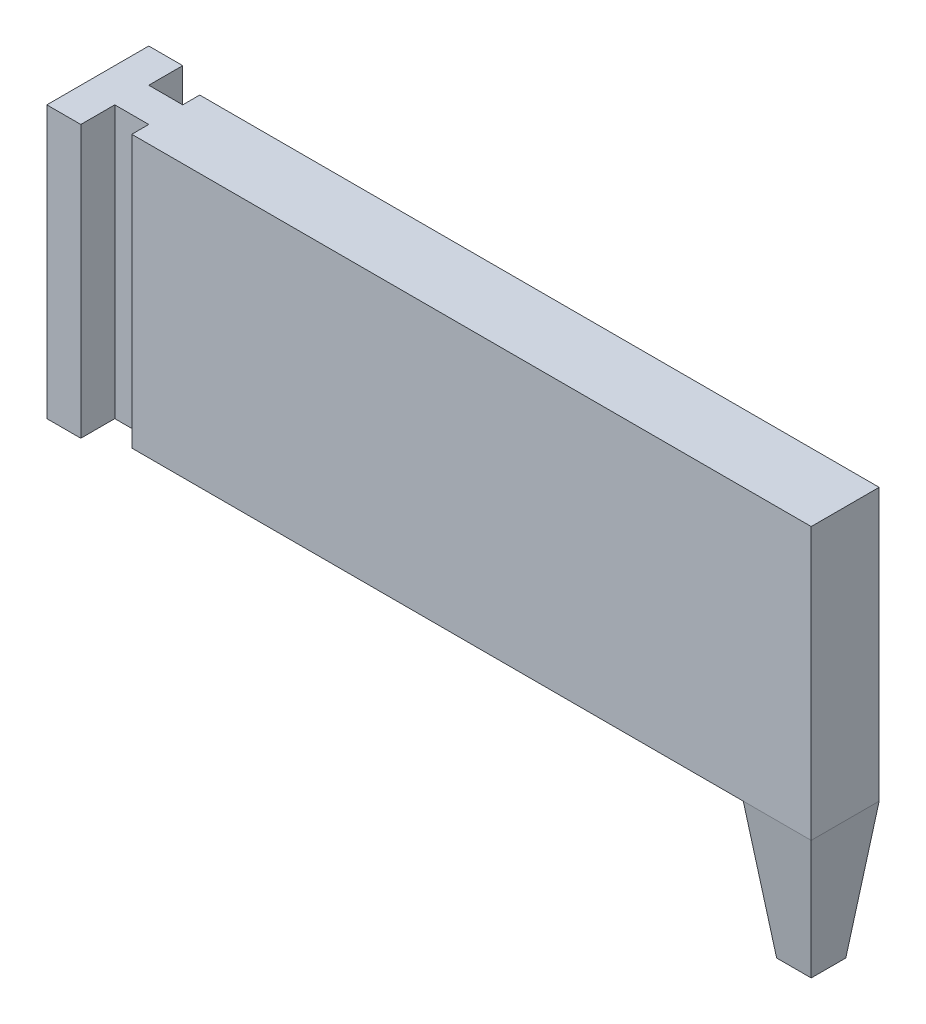
ISO-10303-21;
HEADER;
FILE_DESCRIPTION(('STEP AP214'),'2;1');
FILE_NAME('part.step','',(''),(''),'','','');
FILE_SCHEMA(('AUTOMOTIVE_DESIGN { 1 0 10303 214 1 1 1 1 }'));
ENDSEC;
DATA;
#1=APPLICATION_CONTEXT('core data for automotive mechanical design processes');
#2=APPLICATION_PROTOCOL_DEFINITION('international standard','automotive_design',2000,#1);
#3=PRODUCT_CONTEXT('',#1,'mechanical');
#4=PRODUCT('Part','Part','',(#3));
#5=PRODUCT_RELATED_PRODUCT_CATEGORY('part','',(#4));
#6=PRODUCT_DEFINITION_FORMATION('','',#4);
#7=PRODUCT_DEFINITION_CONTEXT('part definition',#1,'design');
#8=PRODUCT_DEFINITION('design','',#6,#7);
#9=PRODUCT_DEFINITION_SHAPE('','',#8);
#10=(LENGTH_UNIT() NAMED_UNIT(*) SI_UNIT(.MILLI.,.METRE.));
#11=(NAMED_UNIT(*) PLANE_ANGLE_UNIT() SI_UNIT($,.RADIAN.));
#12=(NAMED_UNIT(*) SI_UNIT($,.STERADIAN.) SOLID_ANGLE_UNIT());
#13=UNCERTAINTY_MEASURE_WITH_UNIT(LENGTH_MEASURE(1.E-05),#10,'distance_accuracy_value','');
#14=(GEOMETRIC_REPRESENTATION_CONTEXT(3) GLOBAL_UNCERTAINTY_ASSIGNED_CONTEXT((#13)) GLOBAL_UNIT_ASSIGNED_CONTEXT((#10,
#11,#12)) REPRESENTATION_CONTEXT('',''));
#15=CARTESIAN_POINT('',(0.,0.,0.));
#16=DIRECTION('',(0.,0.,1.));
#17=DIRECTION('',(1.,0.,0.));
#18=AXIS2_PLACEMENT_3D('',#15,#16,#17);
#19=CARTESIAN_POINT('',(0.,0.,0.));
#20=DIRECTION('',(0.,1.,0.));
#21=DIRECTION('',(0.,0.,1.));
#22=AXIS2_PLACEMENT_3D('',#19,#20,#21);
#23=PLANE('',#22);
#24=DIRECTION('',(0.,0.,-1.));
#25=VECTOR('',#24,1.);
#26=CARTESIAN_POINT('',(90.,0.,-5.));
#27=LINE('',#26,#25);
#28=CARTESIAN_POINT('',(90.,0.,5.));
#29=VERTEX_POINT('',#28);
#30=CARTESIAN_POINT('',(90.,0.,-5.));
#31=VERTEX_POINT('',#30);
#32=EDGE_CURVE('E61',#29,#31,#27,.T.);
#33=ORIENTED_EDGE('',*,*,#32,.F.);
#34=DIRECTION('',(1.,0.,0.));
#35=VECTOR('',#34,1.);
#36=CARTESIAN_POINT('',(0.,0.,5.));
#37=LINE('',#36,#35);
#38=CARTESIAN_POINT('',(0.,0.,5.));
#39=VERTEX_POINT('',#38);
#40=EDGE_CURVE('E435',#39,#29,#37,.T.);
#41=ORIENTED_EDGE('',*,*,#40,.F.);
#42=DIRECTION('',(0.,0.,1.));
#43=VECTOR('',#42,1.);
#44=CARTESIAN_POINT('',(0.,0.,-5.));
#45=LINE('',#44,#43);
#46=CARTESIAN_POINT('',(0.,0.,2.5));
#47=VERTEX_POINT('',#46);
#48=EDGE_CURVE('E175',#47,#39,#45,.T.);
#49=ORIENTED_EDGE('',*,*,#48,.F.);
#50=DIRECTION('',(1.,0.,0.));
#51=VECTOR('',#50,1.);
#52=CARTESIAN_POINT('',(-5.,0.,2.5));
#53=LINE('',#52,#51);
#54=CARTESIAN_POINT('',(-5.,0.,2.5));
#55=VERTEX_POINT('',#54);
#56=EDGE_CURVE('E200',#55,#47,#53,.T.);
#57=ORIENTED_EDGE('',*,*,#56,.F.);
#58=DIRECTION('',(0.,0.,-1.));
#59=VECTOR('',#58,1.);
#60=CARTESIAN_POINT('',(-5.00000000000001,0.,7.5));
#61=LINE('',#60,#59);
#62=CARTESIAN_POINT('',(-5.00000000000001,0.,7.5));
#63=VERTEX_POINT('',#62);
#64=EDGE_CURVE('E197',#63,#55,#61,.T.);
#65=ORIENTED_EDGE('',*,*,#64,.F.);
#66=DIRECTION('',(1.,0.,0.));
#67=VECTOR('',#66,1.);
#68=CARTESIAN_POINT('',(-10.,0.,7.5));
#69=LINE('',#68,#67);
#70=CARTESIAN_POINT('',(-10.,0.,7.5));
#71=VERTEX_POINT('',#70);
#72=EDGE_CURVE('E194',#71,#63,#69,.T.);
#73=ORIENTED_EDGE('',*,*,#72,.F.);
#74=DIRECTION('',(0.,0.,1.));
#75=VECTOR('',#74,1.);
#76=CARTESIAN_POINT('',(-10.,0.,-7.5));
#77=LINE('',#76,#75);
#78=CARTESIAN_POINT('',(-10.,0.,-7.5));
#79=VERTEX_POINT('',#78);
#80=EDGE_CURVE('E159',#79,#71,#77,.T.);
#81=ORIENTED_EDGE('',*,*,#80,.F.);
#82=DIRECTION('',(-1.,0.,0.));
#83=VECTOR('',#82,1.);
#84=CARTESIAN_POINT('',(-5.00000000000001,0.,-7.5));
#85=LINE('',#84,#83);
#86=CARTESIAN_POINT('',(-5.00000000000001,0.,-7.5));
#87=VERTEX_POINT('',#86);
#88=EDGE_CURVE('E153',#87,#79,#85,.T.);
#89=ORIENTED_EDGE('',*,*,#88,.F.);
#90=DIRECTION('',(0.,0.,-1.));
#91=VECTOR('',#90,1.);
#92=CARTESIAN_POINT('',(-5.,0.,-2.5));
#93=LINE('',#92,#91);
#94=CARTESIAN_POINT('',(-5.,0.,-2.5));
#95=VERTEX_POINT('',#94);
#96=EDGE_CURVE('E100',#95,#87,#93,.T.);
#97=ORIENTED_EDGE('',*,*,#96,.F.);
#98=DIRECTION('',(-1.,0.,0.));
#99=VECTOR('',#98,1.);
#100=CARTESIAN_POINT('',(0.,0.,-2.5));
#101=LINE('',#100,#99);
#102=CARTESIAN_POINT('',(0.,0.,-2.5));
#103=VERTEX_POINT('',#102);
#104=EDGE_CURVE('E204',#103,#95,#101,.T.);
#105=ORIENTED_EDGE('',*,*,#104,.F.);
#106=CARTESIAN_POINT('',(0.,0.,-5.));
#107=VERTEX_POINT('',#106);
#108=EDGE_CURVE('E143',#107,#103,#45,.T.);
#109=ORIENTED_EDGE('',*,*,#108,.F.);
#110=DIRECTION('',(1.,0.,0.));
#111=VECTOR('',#110,1.);
#112=CARTESIAN_POINT('',(0.,0.,-5.));
#113=LINE('',#112,#111);
#114=EDGE_CURVE('E468',#107,#31,#113,.T.);
#115=ORIENTED_EDGE('',*,*,#114,.T.);
#116=EDGE_LOOP('',(#33,#41,#49,#57,#65,#73,#81,#89,#97,#105,#109,#115));
#117=FACE_BOUND('',#116,.T.);
#118=ADVANCED_FACE('F45',(#117),#23,.F.);
#119=CARTESIAN_POINT('',(-5.00000000000001,40.,-7.5));
#120=DIRECTION('',(0.,0.,1.));
#121=DIRECTION('',(1.,0.,0.));
#122=AXIS2_PLACEMENT_3D('',#119,#120,#121);
#123=PLANE('',#122);
#124=ORIENTED_EDGE('',*,*,#88,.T.);
#125=DIRECTION('',(0.,-1.,0.));
#126=VECTOR('',#125,1.);
#127=CARTESIAN_POINT('',(-10.,40.,-7.5));
#128=LINE('',#127,#126);
#129=CARTESIAN_POINT('',(-10.,40.,-7.5));
#130=VERTEX_POINT('',#129);
#131=EDGE_CURVE('E11',#130,#79,#128,.T.);
#132=ORIENTED_EDGE('',*,*,#131,.F.);
#133=DIRECTION('',(-1.,0.,0.));
#134=VECTOR('',#133,1.);
#135=CARTESIAN_POINT('',(-5.00000000000001,40.,-7.5));
#136=LINE('',#135,#134);
#137=CARTESIAN_POINT('',(-5.00000000000001,40.,-7.5));
#138=VERTEX_POINT('',#137);
#139=EDGE_CURVE('E176',#138,#130,#136,.T.);
#140=ORIENTED_EDGE('',*,*,#139,.F.);
#141=DIRECTION('',(0.,-1.,0.));
#142=VECTOR('',#141,1.);
#143=CARTESIAN_POINT('',(-5.00000000000001,40.,-7.5));
#144=LINE('',#143,#142);
#145=EDGE_CURVE('E190',#138,#87,#144,.T.);
#146=ORIENTED_EDGE('',*,*,#145,.T.);
#147=EDGE_LOOP('',(#124,#132,#140,#146));
#148=FACE_BOUND('',#147,.T.);
#149=ADVANCED_FACE('F47',(#148),#123,.F.);
#150=CARTESIAN_POINT('',(-10.,40.,-7.5));
#151=DIRECTION('',(1.,0.,0.));
#152=DIRECTION('',(0.,0.,-1.));
#153=AXIS2_PLACEMENT_3D('',#150,#151,#152);
#154=PLANE('',#153);
#155=ORIENTED_EDGE('',*,*,#80,.T.);
#156=DIRECTION('',(0.,-1.,0.));
#157=VECTOR('',#156,1.);
#158=CARTESIAN_POINT('',(-10.,40.,7.5));
#159=LINE('',#158,#157);
#160=CARTESIAN_POINT('',(-10.,40.,7.5));
#161=VERTEX_POINT('',#160);
#162=EDGE_CURVE('E54',#161,#71,#159,.T.);
#163=ORIENTED_EDGE('',*,*,#162,.F.);
#164=DIRECTION('',(0.,0.,1.));
#165=VECTOR('',#164,1.);
#166=CARTESIAN_POINT('',(-10.,40.,-7.5));
#167=LINE('',#166,#165);
#168=EDGE_CURVE('E108',#130,#161,#167,.T.);
#169=ORIENTED_EDGE('',*,*,#168,.F.);
#170=ORIENTED_EDGE('',*,*,#131,.T.);
#171=EDGE_LOOP('',(#155,#163,#169,#170));
#172=FACE_BOUND('',#171,.T.);
#173=ADVANCED_FACE('F249',(#172),#154,.F.);
#174=CARTESIAN_POINT('',(-10.,40.,7.5));
#175=DIRECTION('',(0.,0.,-1.));
#176=DIRECTION('',(-1.,0.,0.));
#177=AXIS2_PLACEMENT_3D('',#174,#175,#176);
#178=PLANE('',#177);
#179=ORIENTED_EDGE('',*,*,#72,.T.);
#180=DIRECTION('',(0.,-1.,0.));
#181=VECTOR('',#180,1.);
#182=CARTESIAN_POINT('',(-5.00000000000001,40.,7.5));
#183=LINE('',#182,#181);
#184=CARTESIAN_POINT('',(-5.00000000000001,40.,7.5));
#185=VERTEX_POINT('',#184);
#186=EDGE_CURVE('E220',#185,#63,#183,.T.);
#187=ORIENTED_EDGE('',*,*,#186,.F.);
#188=DIRECTION('',(1.,0.,0.));
#189=VECTOR('',#188,1.);
#190=CARTESIAN_POINT('',(-10.,40.,7.5));
#191=LINE('',#190,#189);
#192=EDGE_CURVE('E181',#161,#185,#191,.T.);
#193=ORIENTED_EDGE('',*,*,#192,.F.);
#194=ORIENTED_EDGE('',*,*,#162,.T.);
#195=EDGE_LOOP('',(#179,#187,#193,#194));
#196=FACE_BOUND('',#195,.T.);
#197=ADVANCED_FACE('F228',(#196),#178,.F.);
#198=CARTESIAN_POINT('',(-5.00000000000001,40.,7.5));
#199=DIRECTION('',(-1.,0.,0.));
#200=DIRECTION('',(0.,0.,1.));
#201=AXIS2_PLACEMENT_3D('',#198,#199,#200);
#202=PLANE('',#201);
#203=ORIENTED_EDGE('',*,*,#64,.T.);
#204=DIRECTION('',(0.,-1.,0.));
#205=VECTOR('',#204,1.);
#206=CARTESIAN_POINT('',(-5.,40.,2.5));
#207=LINE('',#206,#205);
#208=CARTESIAN_POINT('',(-5.,40.,2.5));
#209=VERTEX_POINT('',#208);
#210=EDGE_CURVE('E216',#209,#55,#207,.T.);
#211=ORIENTED_EDGE('',*,*,#210,.F.);
#212=DIRECTION('',(0.,0.,-1.));
#213=VECTOR('',#212,1.);
#214=CARTESIAN_POINT('',(-5.00000000000001,40.,7.5));
#215=LINE('',#214,#213);
#216=EDGE_CURVE('E184',#185,#209,#215,.T.);
#217=ORIENTED_EDGE('',*,*,#216,.F.);
#218=ORIENTED_EDGE('',*,*,#186,.T.);
#219=EDGE_LOOP('',(#203,#211,#217,#218));
#220=FACE_BOUND('',#219,.T.);
#221=ADVANCED_FACE('F236',(#220),#202,.F.);
#222=CARTESIAN_POINT('',(-5.,40.,2.5));
#223=DIRECTION('',(0.,0.,-1.));
#224=DIRECTION('',(-1.,0.,0.));
#225=AXIS2_PLACEMENT_3D('',#222,#223,#224);
#226=PLANE('',#225);
#227=ORIENTED_EDGE('',*,*,#56,.T.);
#228=DIRECTION('',(0.,-1.,0.));
#229=VECTOR('',#228,1.);
#230=CARTESIAN_POINT('',(0.,40.,2.5));
#231=LINE('',#230,#229);
#232=CARTESIAN_POINT('',(0.,40.,2.5));
#233=VERTEX_POINT('',#232);
#234=EDGE_CURVE('E145',#233,#47,#231,.T.);
#235=ORIENTED_EDGE('',*,*,#234,.F.);
#236=DIRECTION('',(1.,0.,0.));
#237=VECTOR('',#236,1.);
#238=CARTESIAN_POINT('',(-5.,40.,2.5));
#239=LINE('',#238,#237);
#240=EDGE_CURVE('E132',#209,#233,#239,.T.);
#241=ORIENTED_EDGE('',*,*,#240,.F.);
#242=ORIENTED_EDGE('',*,*,#210,.T.);
#243=EDGE_LOOP('',(#227,#235,#241,#242));
#244=FACE_BOUND('',#243,.T.);
#245=ADVANCED_FACE('F240',(#244),#226,.F.);
#246=CARTESIAN_POINT('',(0.,40.,-2.5));
#247=DIRECTION('',(0.,0.,1.));
#248=DIRECTION('',(1.,0.,0.));
#249=AXIS2_PLACEMENT_3D('',#246,#247,#248);
#250=PLANE('',#249);
#251=ORIENTED_EDGE('',*,*,#104,.T.);
#252=DIRECTION('',(0.,-1.,0.));
#253=VECTOR('',#252,1.);
#254=CARTESIAN_POINT('',(-5.,40.,-2.5));
#255=LINE('',#254,#253);
#256=CARTESIAN_POINT('',(-5.,40.,-2.5));
#257=VERTEX_POINT('',#256);
#258=EDGE_CURVE('E129',#257,#95,#255,.T.);
#259=ORIENTED_EDGE('',*,*,#258,.F.);
#260=DIRECTION('',(-1.,0.,0.));
#261=VECTOR('',#260,1.);
#262=CARTESIAN_POINT('',(0.,40.,-2.5));
#263=LINE('',#262,#261);
#264=CARTESIAN_POINT('',(0.,40.,-2.5));
#265=VERTEX_POINT('',#264);
#266=EDGE_CURVE('E124',#265,#257,#263,.T.);
#267=ORIENTED_EDGE('',*,*,#266,.F.);
#268=DIRECTION('',(0.,-1.,0.));
#269=VECTOR('',#268,1.);
#270=CARTESIAN_POINT('',(0.,40.,-2.5));
#271=LINE('',#270,#269);
#272=EDGE_CURVE('E127',#265,#103,#271,.T.);
#273=ORIENTED_EDGE('',*,*,#272,.T.);
#274=EDGE_LOOP('',(#251,#259,#267,#273));
#275=FACE_BOUND('',#274,.T.);
#276=ADVANCED_FACE('F126',(#275),#250,.F.);
#277=CARTESIAN_POINT('',(-5.,40.,-2.5));
#278=DIRECTION('',(-1.,0.,0.));
#279=DIRECTION('',(0.,0.,1.));
#280=AXIS2_PLACEMENT_3D('',#277,#278,#279);
#281=PLANE('',#280);
#282=ORIENTED_EDGE('',*,*,#96,.T.);
#283=ORIENTED_EDGE('',*,*,#145,.F.);
#284=DIRECTION('',(0.,0.,-1.));
#285=VECTOR('',#284,1.);
#286=CARTESIAN_POINT('',(-5.,40.,-2.5));
#287=LINE('',#286,#285);
#288=EDGE_CURVE('E70',#257,#138,#287,.T.);
#289=ORIENTED_EDGE('',*,*,#288,.F.);
#290=ORIENTED_EDGE('',*,*,#258,.T.);
#291=EDGE_LOOP('',(#282,#283,#289,#290));
#292=FACE_BOUND('',#291,.T.);
#293=ADVANCED_FACE('F265',(#292),#281,.F.);
#294=CARTESIAN_POINT('',(0.,40.,0.));
#295=DIRECTION('',(0.,1.,0.));
#296=DIRECTION('',(0.,0.,1.));
#297=AXIS2_PLACEMENT_3D('',#294,#295,#296);
#298=PLANE('',#297);
#299=ORIENTED_EDGE('',*,*,#139,.T.);
#300=ORIENTED_EDGE('',*,*,#168,.T.);
#301=ORIENTED_EDGE('',*,*,#192,.T.);
#302=ORIENTED_EDGE('',*,*,#216,.T.);
#303=ORIENTED_EDGE('',*,*,#240,.T.);
#304=DIRECTION('',(0.,0.,1.));
#305=VECTOR('',#304,1.);
#306=CARTESIAN_POINT('',(0.,40.,-5.));
#307=LINE('',#306,#305);
#308=CARTESIAN_POINT('',(0.,40.,5.));
#309=VERTEX_POINT('',#308);
#310=EDGE_CURVE('E154',#233,#309,#307,.T.);
#311=ORIENTED_EDGE('',*,*,#310,.T.);
#312=DIRECTION('',(-1.,0.,0.));
#313=VECTOR('',#312,1.);
#314=CARTESIAN_POINT('',(100.,40.0000000000007,5.));
#315=LINE('',#314,#313);
#316=CARTESIAN_POINT('',(100.,40.0000000000007,5.));
#317=VERTEX_POINT('',#316);
#318=EDGE_CURVE('E462',#317,#309,#315,.T.);
#319=ORIENTED_EDGE('',*,*,#318,.F.);
#320=DIRECTION('',(0.,0.,1.));
#321=VECTOR('',#320,1.);
#322=CARTESIAN_POINT('',(100.,40.0000000000007,-5.));
#323=LINE('',#322,#321);
#324=CARTESIAN_POINT('',(100.,40.0000000000007,-5.));
#325=VERTEX_POINT('',#324);
#326=EDGE_CURVE('E162',#325,#317,#323,.T.);
#327=ORIENTED_EDGE('',*,*,#326,.F.);
#328=DIRECTION('',(-1.,0.,0.));
#329=VECTOR('',#328,1.);
#330=CARTESIAN_POINT('',(100.,40.0000000000007,-5.));
#331=LINE('',#330,#329);
#332=CARTESIAN_POINT('',(0.,40.,-5.));
#333=VERTEX_POINT('',#332);
#334=EDGE_CURVE('E151',#325,#333,#331,.T.);
#335=ORIENTED_EDGE('',*,*,#334,.T.);
#336=EDGE_CURVE('E140',#333,#265,#307,.T.);
#337=ORIENTED_EDGE('',*,*,#336,.T.);
#338=ORIENTED_EDGE('',*,*,#266,.T.);
#339=ORIENTED_EDGE('',*,*,#288,.T.);
#340=EDGE_LOOP('',(#299,#300,#301,#302,#303,#311,#319,#327,#335,#337,#338,#339));
#341=FACE_BOUND('',#340,.T.);
#342=ADVANCED_FACE('F148',(#341),#298,.T.);
#343=CARTESIAN_POINT('',(0.,40.,-5.));
#344=DIRECTION('',(-1.,0.,0.));
#345=DIRECTION('',(0.,0.,1.));
#346=AXIS2_PLACEMENT_3D('',#343,#344,#345);
#347=PLANE('',#346);
#348=ORIENTED_EDGE('',*,*,#272,.F.);
#349=ORIENTED_EDGE('',*,*,#336,.F.);
#350=DIRECTION('',(0.,-1.,0.));
#351=VECTOR('',#350,1.);
#352=CARTESIAN_POINT('',(0.,40.,-5.));
#353=LINE('',#352,#351);
#354=EDGE_CURVE('E465',#333,#107,#353,.T.);
#355=ORIENTED_EDGE('',*,*,#354,.T.);
#356=ORIENTED_EDGE('',*,*,#108,.T.);
#357=EDGE_LOOP('',(#348,#349,#355,#356));
#358=FACE_BOUND('',#357,.T.);
#359=ADVANCED_FACE('F137',(#358),#347,.T.);
#360=ORIENTED_EDGE('',*,*,#310,.F.);
#361=ORIENTED_EDGE('',*,*,#234,.T.);
#362=ORIENTED_EDGE('',*,*,#48,.T.);
#363=DIRECTION('',(0.,-1.,0.));
#364=VECTOR('',#363,1.);
#365=CARTESIAN_POINT('',(0.,40.,5.));
#366=LINE('',#365,#364);
#367=EDGE_CURVE('E429',#309,#39,#366,.T.);
#368=ORIENTED_EDGE('',*,*,#367,.F.);
#369=EDGE_LOOP('',(#360,#361,#362,#368));
#370=FACE_BOUND('',#369,.T.);
#371=ADVANCED_FACE('F304',(#370),#347,.T.);
#372=CARTESIAN_POINT('',(100.,0.,-5.));
#373=DIRECTION('',(1.,0.,0.));
#374=DIRECTION('',(0.,1.,0.));
#375=AXIS2_PLACEMENT_3D('',#372,#373,#374);
#376=PLANE('',#375);
#377=ORIENTED_EDGE('',*,*,#326,.T.);
#378=DIRECTION('',(0.,1.,0.));
#379=VECTOR('',#378,1.);
#380=CARTESIAN_POINT('',(100.,0.,5.));
#381=LINE('',#380,#379);
#382=CARTESIAN_POINT('',(100.,0.,5.));
#383=VERTEX_POINT('',#382);
#384=EDGE_CURVE('E458',#383,#317,#381,.T.);
#385=ORIENTED_EDGE('',*,*,#384,.F.);
#386=DIRECTION('',(0.,0.,1.));
#387=VECTOR('',#386,1.);
#388=CARTESIAN_POINT('',(100.,0.,-5.));
#389=LINE('',#388,#387);
#390=CARTESIAN_POINT('',(100.,0.,-5.));
#391=VERTEX_POINT('',#390);
#392=EDGE_CURVE('E169',#391,#383,#389,.T.);
#393=ORIENTED_EDGE('',*,*,#392,.F.);
#394=DIRECTION('',(0.,1.,0.));
#395=VECTOR('',#394,1.);
#396=CARTESIAN_POINT('',(100.,0.,-5.));
#397=LINE('',#396,#395);
#398=EDGE_CURVE('E470',#391,#325,#397,.T.);
#399=ORIENTED_EDGE('',*,*,#398,.T.);
#400=EDGE_LOOP('',(#377,#385,#393,#399));
#401=FACE_BOUND('',#400,.T.);
#402=ADVANCED_FACE('F310',(#401),#376,.T.);
#403=CARTESIAN_POINT('',(0.,0.,-5.));
#404=DIRECTION('',(0.,0.,1.));
#405=DIRECTION('',(1.,0.,0.));
#406=AXIS2_PLACEMENT_3D('',#403,#404,#405);
#407=PLANE('',#406);
#408=ORIENTED_EDGE('',*,*,#354,.F.);
#409=ORIENTED_EDGE('',*,*,#334,.F.);
#410=ORIENTED_EDGE('',*,*,#398,.F.);
#411=DIRECTION('',(1.,0.,0.));
#412=VECTOR('',#411,1.);
#413=CARTESIAN_POINT('',(100.,0.,-5.));
#414=LINE('',#413,#412);
#415=EDGE_CURVE('E421',#31,#391,#414,.T.);
#416=ORIENTED_EDGE('',*,*,#415,.F.);
#417=ORIENTED_EDGE('',*,*,#114,.F.);
#418=EDGE_LOOP('',(#408,#409,#410,#416,#417));
#419=FACE_BOUND('',#418,.T.);
#420=ADVANCED_FACE('F321',(#419),#407,.F.);
#421=CARTESIAN_POINT('',(0.,0.,5.));
#422=DIRECTION('',(0.,0.,1.));
#423=DIRECTION('',(1.,0.,0.));
#424=AXIS2_PLACEMENT_3D('',#421,#422,#423);
#425=PLANE('',#424);
#426=ORIENTED_EDGE('',*,*,#367,.T.);
#427=ORIENTED_EDGE('',*,*,#40,.T.);
#428=DIRECTION('',(-1.,0.,0.));
#429=VECTOR('',#428,1.);
#430=CARTESIAN_POINT('',(100.,0.,5.));
#431=LINE('',#430,#429);
#432=EDGE_CURVE('E498',#383,#29,#431,.T.);
#433=ORIENTED_EDGE('',*,*,#432,.F.);
#434=ORIENTED_EDGE('',*,*,#384,.T.);
#435=ORIENTED_EDGE('',*,*,#318,.T.);
#436=EDGE_LOOP('',(#426,#427,#433,#434,#435));
#437=FACE_BOUND('',#436,.T.);
#438=ADVANCED_FACE('F331',(#437),#425,.T.);
#439=CARTESIAN_POINT('',(100.,0.,-5.));
#440=DIRECTION('',(0.992546151641322,-0.121869343405148,0.));
#441=DIRECTION('',(0.121869343405148,0.992546151641322,0.));
#442=AXIS2_PLACEMENT_3D('',#439,#440,#441);
#443=PLANE('',#442);
#444=ORIENTED_EDGE('',*,*,#392,.T.);
#445=DIRECTION('',(0.120974291151355,0.985256536015293,0.120974291151355));
#446=VECTOR('',#445,1.);
#447=CARTESIAN_POINT('',(100.,0.,5.));
#448=LINE('',#447,#446);
#449=CARTESIAN_POINT('',(97.5443087819419,-20.,2.54430878194191));
#450=VERTEX_POINT('',#449);
#451=EDGE_CURVE('E424',#450,#383,#448,.T.);
#452=ORIENTED_EDGE('',*,*,#451,.F.);
#453=DIRECTION('',(0.,0.,-1.));
#454=VECTOR('',#453,1.);
#455=CARTESIAN_POINT('',(97.5443087819419,-20.,-5.));
#456=LINE('',#455,#454);
#457=CARTESIAN_POINT('',(97.5443087819419,-20.,-2.54430878194191));
#458=VERTEX_POINT('',#457);
#459=EDGE_CURVE('E406',#458,#450,#456,.F.);
#460=ORIENTED_EDGE('',*,*,#459,.F.);
#461=DIRECTION('',(0.120974291151355,0.985256536015293,-0.120974291151355));
#462=VECTOR('',#461,1.);
#463=CARTESIAN_POINT('',(100.,0.,-5.));
#464=LINE('',#463,#462);
#465=EDGE_CURVE('E443',#458,#391,#464,.T.);
#466=ORIENTED_EDGE('',*,*,#465,.T.);
#467=EDGE_LOOP('',(#444,#452,#460,#466));
#468=FACE_BOUND('',#467,.T.);
#469=ADVANCED_FACE('F341',(#468),#443,.T.);
#470=CARTESIAN_POINT('',(100.,0.,5.));
#471=DIRECTION('',(0.,-0.121869343405148,0.992546151641322));
#472=DIRECTION('',(0.,-0.992546151641322,-0.121869343405148));
#473=AXIS2_PLACEMENT_3D('',#470,#471,#472);
#474=PLANE('',#473);
#475=ORIENTED_EDGE('',*,*,#432,.T.);
#476=DIRECTION('',(-0.120974291151355,0.985256536015293,0.120974291151355));
#477=VECTOR('',#476,1.);
#478=CARTESIAN_POINT('',(90.1463477911958,-1.19190711046689,4.85365220880427));
#479=LINE('',#478,#477);
#480=CARTESIAN_POINT('',(92.4556912180581,-20.,2.54430878194191));
#481=VERTEX_POINT('',#480);
#482=EDGE_CURVE('E430',#481,#29,#479,.T.);
#483=ORIENTED_EDGE('',*,*,#482,.F.);
#484=DIRECTION('',(1.,0.,0.));
#485=VECTOR('',#484,1.);
#486=CARTESIAN_POINT('',(100.,-20.,2.54430878194191));
#487=LINE('',#486,#485);
#488=EDGE_CURVE('E411',#450,#481,#487,.F.);
#489=ORIENTED_EDGE('',*,*,#488,.F.);
#490=ORIENTED_EDGE('',*,*,#451,.T.);
#491=EDGE_LOOP('',(#475,#483,#489,#490));
#492=FACE_BOUND('',#491,.T.);
#493=ADVANCED_FACE('F358',(#492),#474,.T.);
#494=CARTESIAN_POINT('',(90.,0.,-5.));
#495=DIRECTION('',(-0.992546151641322,-0.121869343405148,0.));
#496=DIRECTION('',(0.121869343405148,-0.992546151641322,0.));
#497=AXIS2_PLACEMENT_3D('',#494,#495,#496);
#498=PLANE('',#497);
#499=ORIENTED_EDGE('',*,*,#32,.T.);
#500=DIRECTION('',(-0.120974291151355,0.985256536015293,-0.120974291151355));
#501=VECTOR('',#500,1.);
#502=CARTESIAN_POINT('',(90.1463477911958,-1.19190711046689,-4.85365220880427));
#503=LINE('',#502,#501);
#504=CARTESIAN_POINT('',(92.4556912180581,-20.,-2.54430878194191));
#505=VERTEX_POINT('',#504);
#506=EDGE_CURVE('E438',#505,#31,#503,.T.);
#507=ORIENTED_EDGE('',*,*,#506,.F.);
#508=DIRECTION('',(0.,0.,1.));
#509=VECTOR('',#508,1.);
#510=CARTESIAN_POINT('',(92.4556912180581,-20.,-5.));
#511=LINE('',#510,#509);
#512=EDGE_CURVE('E451',#481,#505,#511,.F.);
#513=ORIENTED_EDGE('',*,*,#512,.F.);
#514=ORIENTED_EDGE('',*,*,#482,.T.);
#515=EDGE_LOOP('',(#499,#507,#513,#514));
#516=FACE_BOUND('',#515,.T.);
#517=ADVANCED_FACE('F368',(#516),#498,.T.);
#518=CARTESIAN_POINT('',(100.,0.,-5.));
#519=DIRECTION('',(0.,-0.121869343405148,-0.992546151641322));
#520=DIRECTION('',(0.,0.992546151641322,-0.121869343405148));
#521=AXIS2_PLACEMENT_3D('',#518,#519,#520);
#522=PLANE('',#521);
#523=ORIENTED_EDGE('',*,*,#415,.T.);
#524=ORIENTED_EDGE('',*,*,#465,.F.);
#525=DIRECTION('',(-1.,0.,0.));
#526=VECTOR('',#525,1.);
#527=CARTESIAN_POINT('',(100.,-20.,-2.54430878194191));
#528=LINE('',#527,#526);
#529=EDGE_CURVE('E415',#505,#458,#528,.F.);
#530=ORIENTED_EDGE('',*,*,#529,.F.);
#531=ORIENTED_EDGE('',*,*,#506,.T.);
#532=EDGE_LOOP('',(#523,#524,#530,#531));
#533=FACE_BOUND('',#532,.T.);
#534=ADVANCED_FACE('F378',(#533),#522,.T.);
#535=CARTESIAN_POINT('',(0.,-20.,0.));
#536=DIRECTION('',(0.,-1.,0.));
#537=DIRECTION('',(0.,0.,-1.));
#538=AXIS2_PLACEMENT_3D('',#535,#536,#537);
#539=PLANE('',#538);
#540=ORIENTED_EDGE('',*,*,#459,.T.);
#541=ORIENTED_EDGE('',*,*,#488,.T.);
#542=ORIENTED_EDGE('',*,*,#512,.T.);
#543=ORIENTED_EDGE('',*,*,#529,.T.);
#544=EDGE_LOOP('',(#540,#541,#542,#543));
#545=FACE_BOUND('',#544,.T.);
#546=ADVANCED_FACE('F388',(#545),#539,.T.);
#547=CLOSED_SHELL('',(#118,#149,#173,#197,#221,#245,#276,#293,#342,#359,#371,#402,#420,#438,
#469,#493,#517,#534,#546));
#548=MANIFOLD_SOLID_BREP('B2',#547);
#549=ADVANCED_BREP_SHAPE_REPRESENTATION('',(#18,#548),#14);
#550=SHAPE_DEFINITION_REPRESENTATION(#9,#549);
ENDSEC;
END-ISO-10303-21;
